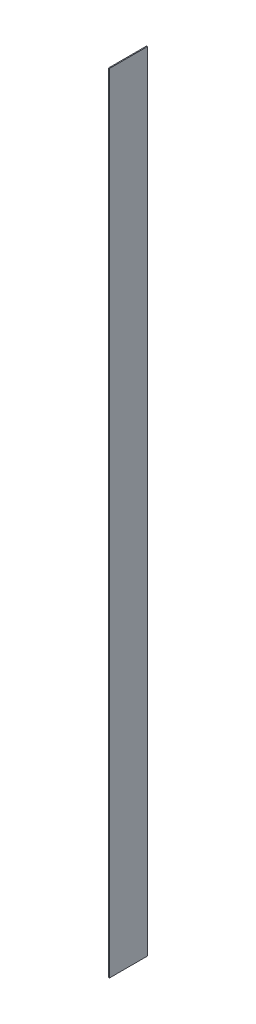
ISO-10303-21;
HEADER;
FILE_DESCRIPTION(('STEP AP214'),'2;1');
FILE_NAME('part.step','',(''),(''),'','','');
FILE_SCHEMA(('AUTOMOTIVE_DESIGN { 1 0 10303 214 1 1 1 1 }'));
ENDSEC;
DATA;
#1=APPLICATION_CONTEXT('core data for automotive mechanical design processes');
#2=APPLICATION_PROTOCOL_DEFINITION('international standard','automotive_design',2000,#1);
#3=PRODUCT_CONTEXT('',#1,'mechanical');
#4=PRODUCT('Part','Part','',(#3));
#5=PRODUCT_RELATED_PRODUCT_CATEGORY('part','',(#4));
#6=PRODUCT_DEFINITION_FORMATION('','',#4);
#7=PRODUCT_DEFINITION_CONTEXT('part definition',#1,'design');
#8=PRODUCT_DEFINITION('design','',#6,#7);
#9=PRODUCT_DEFINITION_SHAPE('','',#8);
#10=(LENGTH_UNIT() NAMED_UNIT(*) SI_UNIT(.MILLI.,.METRE.));
#11=(NAMED_UNIT(*) PLANE_ANGLE_UNIT() SI_UNIT($,.RADIAN.));
#12=(NAMED_UNIT(*) SI_UNIT($,.STERADIAN.) SOLID_ANGLE_UNIT());
#13=UNCERTAINTY_MEASURE_WITH_UNIT(LENGTH_MEASURE(1.E-05),#10,'distance_accuracy_value','');
#14=(GEOMETRIC_REPRESENTATION_CONTEXT(3) GLOBAL_UNCERTAINTY_ASSIGNED_CONTEXT((#13)) GLOBAL_UNIT_ASSIGNED_CONTEXT((#10,
#11,#12)) REPRESENTATION_CONTEXT('',''));
#15=CARTESIAN_POINT('',(0.,0.,0.));
#16=DIRECTION('',(0.,0.,1.));
#17=DIRECTION('',(1.,0.,0.));
#18=AXIS2_PLACEMENT_3D('',#15,#16,#17);
#19=CARTESIAN_POINT('',(1.27,0.,25.4));
#20=DIRECTION('',(0.,0.,-1.));
#21=DIRECTION('',(-1.,0.,0.));
#22=AXIS2_PLACEMENT_3D('',#19,#20,#21);
#23=PLANE('',#22);
#24=DIRECTION('',(0.,-1.,0.));
#25=VECTOR('',#24,1.);
#26=CARTESIAN_POINT('',(0.,0.,25.4));
#27=LINE('',#26,#25);
#28=CARTESIAN_POINT('',(0.,1054.1,25.4));
#29=VERTEX_POINT('',#28);
#30=CARTESIAN_POINT('',(0.,0.,25.4));
#31=VERTEX_POINT('',#30);
#32=EDGE_CURVE('E96',#29,#31,#27,.T.);
#33=ORIENTED_EDGE('',*,*,#32,.T.);
#34=DIRECTION('',(-1.,0.,0.));
#35=VECTOR('',#34,1.);
#36=CARTESIAN_POINT('',(1.27,0.,25.4));
#37=LINE('',#36,#35);
#38=CARTESIAN_POINT('',(1.27,0.,25.4));
#39=VERTEX_POINT('',#38);
#40=EDGE_CURVE('E11',#39,#31,#37,.T.);
#41=ORIENTED_EDGE('',*,*,#40,.F.);
#42=DIRECTION('',(0.,-1.,0.));
#43=VECTOR('',#42,1.);
#44=CARTESIAN_POINT('',(1.27,0.,25.4));
#45=LINE('',#44,#43);
#46=CARTESIAN_POINT('',(1.27,1054.1,25.4));
#47=VERTEX_POINT('',#46);
#48=EDGE_CURVE('E84',#47,#39,#45,.T.);
#49=ORIENTED_EDGE('',*,*,#48,.F.);
#50=DIRECTION('',(-1.,0.,0.));
#51=VECTOR('',#50,1.);
#52=CARTESIAN_POINT('',(1.27,1054.1,25.4));
#53=LINE('',#52,#51);
#54=EDGE_CURVE('E92',#47,#29,#53,.T.);
#55=ORIENTED_EDGE('',*,*,#54,.T.);
#56=EDGE_LOOP('',(#33,#41,#49,#55));
#57=FACE_BOUND('',#56,.T.);
#58=ADVANCED_FACE('F33',(#57),#23,.F.);
#59=CARTESIAN_POINT('',(1.27,0.,25.4));
#60=DIRECTION('',(0.,1.,0.));
#61=DIRECTION('',(0.,0.,1.));
#62=AXIS2_PLACEMENT_3D('',#59,#60,#61);
#63=PLANE('',#62);
#64=DIRECTION('',(0.,0.,-1.));
#65=VECTOR('',#64,1.);
#66=CARTESIAN_POINT('',(0.,0.,25.4));
#67=LINE('',#66,#65);
#68=CARTESIAN_POINT('',(0.,0.,-25.4));
#69=VERTEX_POINT('',#68);
#70=EDGE_CURVE('E88',#31,#69,#67,.T.);
#71=ORIENTED_EDGE('',*,*,#70,.T.);
#72=DIRECTION('',(-1.,0.,0.));
#73=VECTOR('',#72,1.);
#74=CARTESIAN_POINT('',(1.27,0.,-25.4));
#75=LINE('',#74,#73);
#76=CARTESIAN_POINT('',(1.27,0.,-25.4));
#77=VERTEX_POINT('',#76);
#78=EDGE_CURVE('E41',#77,#69,#75,.T.);
#79=ORIENTED_EDGE('',*,*,#78,.F.);
#80=DIRECTION('',(0.,0.,-1.));
#81=VECTOR('',#80,1.);
#82=CARTESIAN_POINT('',(1.27,0.,25.4));
#83=LINE('',#82,#81);
#84=EDGE_CURVE('E79',#39,#77,#83,.T.);
#85=ORIENTED_EDGE('',*,*,#84,.F.);
#86=ORIENTED_EDGE('',*,*,#40,.T.);
#87=EDGE_LOOP('',(#71,#79,#85,#86));
#88=FACE_BOUND('',#87,.T.);
#89=ADVANCED_FACE('F87',(#88),#63,.F.);
#90=CARTESIAN_POINT('',(1.27,0.,-25.4));
#91=DIRECTION('',(0.,0.,1.));
#92=DIRECTION('',(1.,0.,0.));
#93=AXIS2_PLACEMENT_3D('',#90,#91,#92);
#94=PLANE('',#93);
#95=DIRECTION('',(0.,1.,0.));
#96=VECTOR('',#95,1.);
#97=CARTESIAN_POINT('',(0.,0.,-25.4));
#98=LINE('',#97,#96);
#99=CARTESIAN_POINT('',(0.,1054.1,-25.4));
#100=VERTEX_POINT('',#99);
#101=EDGE_CURVE('E66',#69,#100,#98,.T.);
#102=ORIENTED_EDGE('',*,*,#101,.T.);
#103=DIRECTION('',(-1.,0.,0.));
#104=VECTOR('',#103,1.);
#105=CARTESIAN_POINT('',(1.27,1054.1,-25.4));
#106=LINE('',#105,#104);
#107=CARTESIAN_POINT('',(1.27,1054.1,-25.4));
#108=VERTEX_POINT('',#107);
#109=EDGE_CURVE('E89',#108,#100,#106,.T.);
#110=ORIENTED_EDGE('',*,*,#109,.F.);
#111=DIRECTION('',(0.,1.,0.));
#112=VECTOR('',#111,1.);
#113=CARTESIAN_POINT('',(1.27,0.,-25.4));
#114=LINE('',#113,#112);
#115=EDGE_CURVE('E82',#77,#108,#114,.T.);
#116=ORIENTED_EDGE('',*,*,#115,.F.);
#117=ORIENTED_EDGE('',*,*,#78,.T.);
#118=EDGE_LOOP('',(#102,#110,#116,#117));
#119=FACE_BOUND('',#118,.T.);
#120=ADVANCED_FACE('F90',(#119),#94,.F.);
#121=CARTESIAN_POINT('',(1.27,1054.1,25.4));
#122=DIRECTION('',(0.,-1.,0.));
#123=DIRECTION('',(0.,0.,-1.));
#124=AXIS2_PLACEMENT_3D('',#121,#122,#123);
#125=PLANE('',#124);
#126=DIRECTION('',(0.,0.,1.));
#127=VECTOR('',#126,1.);
#128=CARTESIAN_POINT('',(0.,1054.1,25.4));
#129=LINE('',#128,#127);
#130=EDGE_CURVE('E72',#100,#29,#129,.T.);
#131=ORIENTED_EDGE('',*,*,#130,.T.);
#132=ORIENTED_EDGE('',*,*,#54,.F.);
#133=DIRECTION('',(0.,0.,1.));
#134=VECTOR('',#133,1.);
#135=CARTESIAN_POINT('',(1.27,1054.1,25.4));
#136=LINE('',#135,#134);
#137=EDGE_CURVE('E49',#108,#47,#136,.T.);
#138=ORIENTED_EDGE('',*,*,#137,.F.);
#139=ORIENTED_EDGE('',*,*,#109,.T.);
#140=EDGE_LOOP('',(#131,#132,#138,#139));
#141=FACE_BOUND('',#140,.T.);
#142=ADVANCED_FACE('F103',(#141),#125,.F.);
#143=CARTESIAN_POINT('',(1.27,0.,0.));
#144=DIRECTION('',(-1.,0.,0.));
#145=DIRECTION('',(0.,0.,1.));
#146=AXIS2_PLACEMENT_3D('',#143,#144,#145);
#147=PLANE('',#146);
#148=ORIENTED_EDGE('',*,*,#48,.T.);
#149=ORIENTED_EDGE('',*,*,#84,.T.);
#150=ORIENTED_EDGE('',*,*,#115,.T.);
#151=ORIENTED_EDGE('',*,*,#137,.T.);
#152=EDGE_LOOP('',(#148,#149,#150,#151));
#153=FACE_BOUND('',#152,.T.);
#154=ADVANCED_FACE('F80',(#153),#147,.F.);
#155=CARTESIAN_POINT('',(0.,0.,0.));
#156=DIRECTION('',(-1.,0.,0.));
#157=DIRECTION('',(0.,0.,1.));
#158=AXIS2_PLACEMENT_3D('',#155,#156,#157);
#159=PLANE('',#158);
#160=ORIENTED_EDGE('',*,*,#32,.F.);
#161=ORIENTED_EDGE('',*,*,#130,.F.);
#162=ORIENTED_EDGE('',*,*,#101,.F.);
#163=ORIENTED_EDGE('',*,*,#70,.F.);
#164=EDGE_LOOP('',(#160,#161,#162,#163));
#165=FACE_BOUND('',#164,.T.);
#166=ADVANCED_FACE('F106',(#165),#159,.T.);
#167=CLOSED_SHELL('',(#58,#89,#120,#142,#154,#166));
#168=MANIFOLD_SOLID_BREP('B2',#167);
#169=ADVANCED_BREP_SHAPE_REPRESENTATION('',(#18,#168),#14);
#170=SHAPE_DEFINITION_REPRESENTATION(#9,#169);
ENDSEC;
END-ISO-10303-21;
